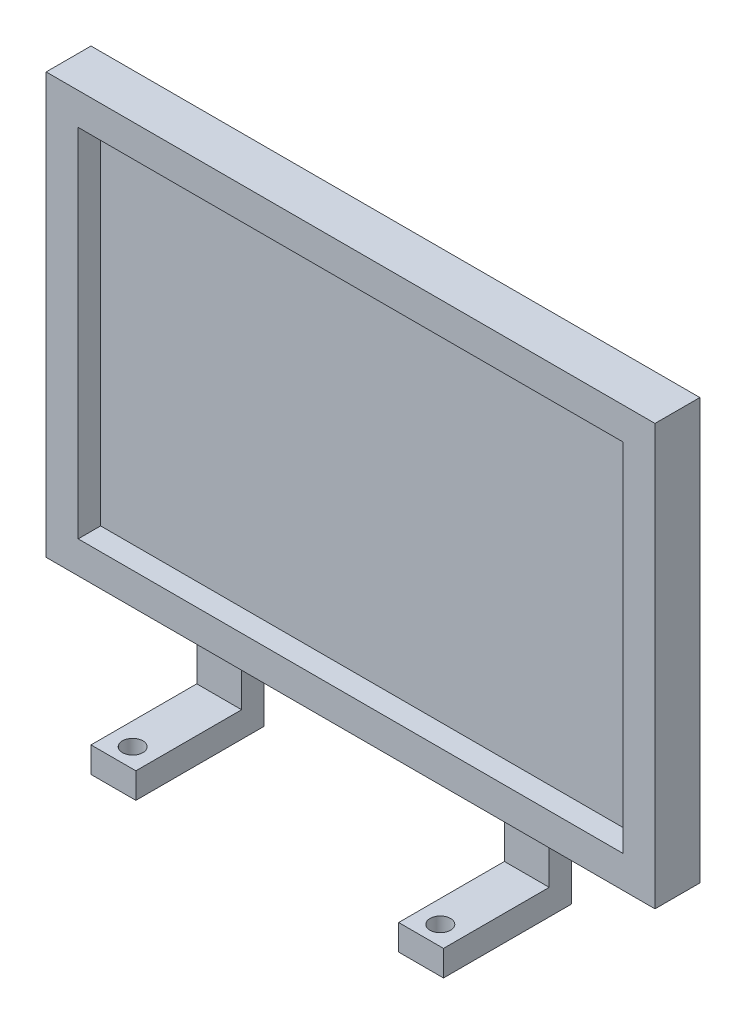
ISO-10303-21;
HEADER;
FILE_DESCRIPTION(('STEP AP214'),'2;1');
FILE_NAME('part.step','',(''),(''),'','','');
FILE_SCHEMA(('AUTOMOTIVE_DESIGN { 1 0 10303 214 1 1 1 1 }'));
ENDSEC;
DATA;
#1=APPLICATION_CONTEXT('core data for automotive mechanical design processes');
#2=APPLICATION_PROTOCOL_DEFINITION('international standard','automotive_design',2000,#1);
#3=PRODUCT_CONTEXT('',#1,'mechanical');
#4=PRODUCT('Part','Part','',(#3));
#5=PRODUCT_RELATED_PRODUCT_CATEGORY('part','',(#4));
#6=PRODUCT_DEFINITION_FORMATION('','',#4);
#7=PRODUCT_DEFINITION_CONTEXT('part definition',#1,'design');
#8=PRODUCT_DEFINITION('design','',#6,#7);
#9=PRODUCT_DEFINITION_SHAPE('','',#8);
#10=(LENGTH_UNIT() NAMED_UNIT(*) SI_UNIT(.MILLI.,.METRE.));
#11=(NAMED_UNIT(*) PLANE_ANGLE_UNIT() SI_UNIT($,.RADIAN.));
#12=(NAMED_UNIT(*) SI_UNIT($,.STERADIAN.) SOLID_ANGLE_UNIT());
#13=UNCERTAINTY_MEASURE_WITH_UNIT(LENGTH_MEASURE(1.E-05),#10,'distance_accuracy_value','');
#14=(GEOMETRIC_REPRESENTATION_CONTEXT(3) GLOBAL_UNCERTAINTY_ASSIGNED_CONTEXT((#13)) GLOBAL_UNIT_ASSIGNED_CONTEXT((#10,
#11,#12)) REPRESENTATION_CONTEXT('',''));
#15=CARTESIAN_POINT('',(0.,0.,0.));
#16=DIRECTION('',(0.,0.,1.));
#17=DIRECTION('',(1.,0.,0.));
#18=AXIS2_PLACEMENT_3D('',#15,#16,#17);
#19=CARTESIAN_POINT('',(0.,-32.8,7.));
#20=DIRECTION('',(0.,1.,0.));
#21=DIRECTION('',(0.,0.,1.));
#22=AXIS2_PLACEMENT_3D('',#19,#20,#21);
#23=PLANE('',#22);
#24=DIRECTION('',(0.,0.,-1.));
#25=VECTOR('',#24,1.);
#26=CARTESIAN_POINT('',(20.5,-32.8,3.5));
#27=LINE('',#26,#25);
#28=CARTESIAN_POINT('',(20.5,-32.8,3.5));
#29=VERTEX_POINT('',#28);
#30=CARTESIAN_POINT('',(20.5,-32.8,0.));
#31=VERTEX_POINT('',#30);
#32=EDGE_CURVE('E64',#29,#31,#27,.T.);
#33=ORIENTED_EDGE('',*,*,#32,.F.);
#34=DIRECTION('',(1.,0.,0.));
#35=VECTOR('',#34,1.);
#36=CARTESIAN_POINT('',(0.,-32.8,3.5));
#37=LINE('',#36,#35);
#38=CARTESIAN_POINT('',(27.5,-32.8,3.5));
#39=VERTEX_POINT('',#38);
#40=EDGE_CURVE('E59',#29,#39,#37,.T.);
#41=ORIENTED_EDGE('',*,*,#40,.T.);
#42=DIRECTION('',(0.,0.,-1.));
#43=VECTOR('',#42,1.);
#44=CARTESIAN_POINT('',(27.5,-32.8,3.5));
#45=LINE('',#44,#43);
#46=CARTESIAN_POINT('',(27.5,-32.8,0.));
#47=VERTEX_POINT('',#46);
#48=EDGE_CURVE('E282',#39,#47,#45,.T.);
#49=ORIENTED_EDGE('',*,*,#48,.T.);
#50=DIRECTION('',(1.,0.,0.));
#51=VECTOR('',#50,1.);
#52=CARTESIAN_POINT('',(0.,-32.8,0.));
#53=LINE('',#52,#51);
#54=CARTESIAN_POINT('',(47.5,-32.8,0.));
#55=VERTEX_POINT('',#54);
#56=EDGE_CURVE('E355',#47,#55,#53,.T.);
#57=ORIENTED_EDGE('',*,*,#56,.T.);
#58=DIRECTION('',(0.,0.,-1.));
#59=VECTOR('',#58,1.);
#60=CARTESIAN_POINT('',(47.5,-32.8,7.));
#61=LINE('',#60,#59);
#62=CARTESIAN_POINT('',(47.5,-32.8,7.));
#63=VERTEX_POINT('',#62);
#64=EDGE_CURVE('E344',#63,#55,#61,.T.);
#65=ORIENTED_EDGE('',*,*,#64,.F.);
#66=DIRECTION('',(1.,0.,0.));
#67=VECTOR('',#66,1.);
#68=CARTESIAN_POINT('',(0.,-32.8,7.));
#69=LINE('',#68,#67);
#70=CARTESIAN_POINT('',(-47.5,-32.8,7.));
#71=VERTEX_POINT('',#70);
#72=EDGE_CURVE('E326',#71,#63,#69,.T.);
#73=ORIENTED_EDGE('',*,*,#72,.F.);
#74=DIRECTION('',(0.,0.,-1.));
#75=VECTOR('',#74,1.);
#76=CARTESIAN_POINT('',(-47.5,-32.8,7.));
#77=LINE('',#76,#75);
#78=CARTESIAN_POINT('',(-47.5,-32.8,0.));
#79=VERTEX_POINT('',#78);
#80=EDGE_CURVE('E380',#71,#79,#77,.T.);
#81=ORIENTED_EDGE('',*,*,#80,.T.);
#82=CARTESIAN_POINT('',(-27.5,-32.8,0.));
#83=VERTEX_POINT('',#82);
#84=EDGE_CURVE('E319',#79,#83,#53,.T.);
#85=ORIENTED_EDGE('',*,*,#84,.T.);
#86=DIRECTION('',(0.,0.,-1.));
#87=VECTOR('',#86,1.);
#88=CARTESIAN_POINT('',(-27.5,-32.8,3.5));
#89=LINE('',#88,#87);
#90=CARTESIAN_POINT('',(-27.5,-32.8,3.5));
#91=VERTEX_POINT('',#90);
#92=EDGE_CURVE('E302',#91,#83,#89,.T.);
#93=ORIENTED_EDGE('',*,*,#92,.F.);
#94=DIRECTION('',(1.,0.,0.));
#95=VECTOR('',#94,1.);
#96=CARTESIAN_POINT('',(0.,-32.8,3.5));
#97=LINE('',#96,#95);
#98=CARTESIAN_POINT('',(-20.5,-32.8,3.5));
#99=VERTEX_POINT('',#98);
#100=EDGE_CURVE('E295',#91,#99,#97,.T.);
#101=ORIENTED_EDGE('',*,*,#100,.T.);
#102=DIRECTION('',(0.,0.,-1.));
#103=VECTOR('',#102,1.);
#104=CARTESIAN_POINT('',(-20.5,-32.8,3.5));
#105=LINE('',#104,#103);
#106=CARTESIAN_POINT('',(-20.5,-32.8,0.));
#107=VERTEX_POINT('',#106);
#108=EDGE_CURVE('E309',#99,#107,#105,.T.);
#109=ORIENTED_EDGE('',*,*,#108,.T.);
#110=EDGE_CURVE('E359',#107,#31,#53,.T.);
#111=ORIENTED_EDGE('',*,*,#110,.T.);
#112=EDGE_LOOP('',(#33,#41,#49,#57,#65,#73,#81,#85,#93,#101,#109,#111));
#113=FACE_BOUND('',#112,.T.);
#114=ADVANCED_FACE('F41',(#113),#23,.F.);
#115=CARTESIAN_POINT('',(0.,0.,3.5));
#116=DIRECTION('',(0.,0.,1.));
#117=DIRECTION('',(1.,0.,0.));
#118=AXIS2_PLACEMENT_3D('',#115,#116,#117);
#119=PLANE('',#118);
#120=DIRECTION('',(0.,-1.,0.));
#121=VECTOR('',#120,1.);
#122=CARTESIAN_POINT('',(42.5,0.,3.5));
#123=LINE('',#122,#121);
#124=CARTESIAN_POINT('',(42.5,27.8,3.5));
#125=VERTEX_POINT('',#124);
#126=CARTESIAN_POINT('',(42.5,-27.8,3.5));
#127=VERTEX_POINT('',#126);
#128=EDGE_CURVE('E376',#125,#127,#123,.T.);
#129=ORIENTED_EDGE('',*,*,#128,.F.);
#130=DIRECTION('',(1.,0.,0.));
#131=VECTOR('',#130,1.);
#132=CARTESIAN_POINT('',(0.,27.8,3.5));
#133=LINE('',#132,#131);
#134=CARTESIAN_POINT('',(-42.5,27.8,3.5));
#135=VERTEX_POINT('',#134);
#136=EDGE_CURVE('E391',#135,#125,#133,.T.);
#137=ORIENTED_EDGE('',*,*,#136,.F.);
#138=DIRECTION('',(0.,-1.,0.));
#139=VECTOR('',#138,1.);
#140=CARTESIAN_POINT('',(-42.5,0.,3.5));
#141=LINE('',#140,#139);
#142=CARTESIAN_POINT('',(-42.5,-27.8,3.5));
#143=VERTEX_POINT('',#142);
#144=EDGE_CURVE('E51',#135,#143,#141,.T.);
#145=ORIENTED_EDGE('',*,*,#144,.T.);
#146=DIRECTION('',(1.,0.,0.));
#147=VECTOR('',#146,1.);
#148=CARTESIAN_POINT('',(0.,-27.8,3.5));
#149=LINE('',#148,#147);
#150=EDGE_CURVE('E11',#143,#127,#149,.T.);
#151=ORIENTED_EDGE('',*,*,#150,.T.);
#152=EDGE_LOOP('',(#129,#137,#145,#151));
#153=FACE_BOUND('',#152,.T.);
#154=ADVANCED_FACE('F441',(#153),#119,.T.);
#155=CARTESIAN_POINT('',(0.,27.8,7.));
#156=DIRECTION('',(0.,1.,0.));
#157=DIRECTION('',(0.,0.,1.));
#158=AXIS2_PLACEMENT_3D('',#155,#156,#157);
#159=PLANE('',#158);
#160=ORIENTED_EDGE('',*,*,#136,.T.);
#161=DIRECTION('',(0.,0.,-1.));
#162=VECTOR('',#161,1.);
#163=CARTESIAN_POINT('',(42.5,27.8,7.));
#164=LINE('',#163,#162);
#165=CARTESIAN_POINT('',(42.5,27.8,7.));
#166=VERTEX_POINT('',#165);
#167=EDGE_CURVE('E372',#166,#125,#164,.T.);
#168=ORIENTED_EDGE('',*,*,#167,.F.);
#169=DIRECTION('',(1.,0.,0.));
#170=VECTOR('',#169,1.);
#171=CARTESIAN_POINT('',(0.,27.8,7.));
#172=LINE('',#171,#170);
#173=CARTESIAN_POINT('',(-42.5,27.8,7.));
#174=VERTEX_POINT('',#173);
#175=EDGE_CURVE('E329',#174,#166,#172,.T.);
#176=ORIENTED_EDGE('',*,*,#175,.F.);
#177=DIRECTION('',(0.,0.,-1.));
#178=VECTOR('',#177,1.);
#179=CARTESIAN_POINT('',(-42.5,27.8,7.));
#180=LINE('',#179,#178);
#181=EDGE_CURVE('E360',#174,#135,#180,.T.);
#182=ORIENTED_EDGE('',*,*,#181,.T.);
#183=EDGE_LOOP('',(#160,#168,#176,#182));
#184=FACE_BOUND('',#183,.T.);
#185=ADVANCED_FACE('F446',(#184),#159,.F.);
#186=CARTESIAN_POINT('',(42.5,0.,7.));
#187=DIRECTION('',(1.,0.,0.));
#188=DIRECTION('',(0.,1.,0.));
#189=AXIS2_PLACEMENT_3D('',#186,#187,#188);
#190=PLANE('',#189);
#191=ORIENTED_EDGE('',*,*,#128,.T.);
#192=DIRECTION('',(0.,0.,-1.));
#193=VECTOR('',#192,1.);
#194=CARTESIAN_POINT('',(42.5,-27.8,7.));
#195=LINE('',#194,#193);
#196=CARTESIAN_POINT('',(42.5,-27.8,7.));
#197=VERTEX_POINT('',#196);
#198=EDGE_CURVE('E368',#197,#127,#195,.T.);
#199=ORIENTED_EDGE('',*,*,#198,.F.);
#200=DIRECTION('',(0.,-1.,0.));
#201=VECTOR('',#200,1.);
#202=CARTESIAN_POINT('',(42.5,0.,7.));
#203=LINE('',#202,#201);
#204=EDGE_CURVE('E333',#166,#197,#203,.T.);
#205=ORIENTED_EDGE('',*,*,#204,.F.);
#206=ORIENTED_EDGE('',*,*,#167,.T.);
#207=EDGE_LOOP('',(#191,#199,#205,#206));
#208=FACE_BOUND('',#207,.T.);
#209=ADVANCED_FACE('F467',(#208),#190,.F.);
#210=CARTESIAN_POINT('',(0.,-27.8,7.));
#211=DIRECTION('',(0.,1.,0.));
#212=DIRECTION('',(0.,0.,1.));
#213=AXIS2_PLACEMENT_3D('',#210,#211,#212);
#214=PLANE('',#213);
#215=ORIENTED_EDGE('',*,*,#198,.T.);
#216=ORIENTED_EDGE('',*,*,#150,.F.);
#217=DIRECTION('',(0.,0.,-1.));
#218=VECTOR('',#217,1.);
#219=CARTESIAN_POINT('',(-42.5,-27.8,7.));
#220=LINE('',#219,#218);
#221=CARTESIAN_POINT('',(-42.5,-27.8,7.));
#222=VERTEX_POINT('',#221);
#223=EDGE_CURVE('E364',#222,#143,#220,.T.);
#224=ORIENTED_EDGE('',*,*,#223,.F.);
#225=DIRECTION('',(1.,0.,0.));
#226=VECTOR('',#225,1.);
#227=CARTESIAN_POINT('',(0.,-27.8,7.));
#228=LINE('',#227,#226);
#229=EDGE_CURVE('E336',#222,#197,#228,.T.);
#230=ORIENTED_EDGE('',*,*,#229,.T.);
#231=EDGE_LOOP('',(#215,#216,#224,#230));
#232=FACE_BOUND('',#231,.T.);
#233=ADVANCED_FACE('F462',(#232),#214,.T.);
#234=CARTESIAN_POINT('',(47.5,0.,7.));
#235=DIRECTION('',(1.,0.,0.));
#236=DIRECTION('',(0.,1.,0.));
#237=AXIS2_PLACEMENT_3D('',#234,#235,#236);
#238=PLANE('',#237);
#239=DIRECTION('',(0.,-1.,0.));
#240=VECTOR('',#239,1.);
#241=CARTESIAN_POINT('',(47.5,0.,0.));
#242=LINE('',#241,#240);
#243=CARTESIAN_POINT('',(47.5,32.8,0.));
#244=VERTEX_POINT('',#243);
#245=EDGE_CURVE('E313',#244,#55,#242,.T.);
#246=ORIENTED_EDGE('',*,*,#245,.F.);
#247=DIRECTION('',(0.,0.,-1.));
#248=VECTOR('',#247,1.);
#249=CARTESIAN_POINT('',(47.5,32.8,7.));
#250=LINE('',#249,#248);
#251=CARTESIAN_POINT('',(47.5,32.8,7.));
#252=VERTEX_POINT('',#251);
#253=EDGE_CURVE('E365',#252,#244,#250,.T.);
#254=ORIENTED_EDGE('',*,*,#253,.F.);
#255=DIRECTION('',(0.,-1.,0.));
#256=VECTOR('',#255,1.);
#257=CARTESIAN_POINT('',(47.5,0.,7.));
#258=LINE('',#257,#256);
#259=EDGE_CURVE('E314',#252,#63,#258,.T.);
#260=ORIENTED_EDGE('',*,*,#259,.T.);
#261=ORIENTED_EDGE('',*,*,#64,.T.);
#262=EDGE_LOOP('',(#246,#254,#260,#261));
#263=FACE_BOUND('',#262,.T.);
#264=ADVANCED_FACE('F459',(#263),#238,.T.);
#265=CARTESIAN_POINT('',(0.,32.8,7.));
#266=DIRECTION('',(0.,1.,0.));
#267=DIRECTION('',(0.,0.,1.));
#268=AXIS2_PLACEMENT_3D('',#265,#266,#267);
#269=PLANE('',#268);
#270=DIRECTION('',(1.,0.,0.));
#271=VECTOR('',#270,1.);
#272=CARTESIAN_POINT('',(0.,32.8,0.));
#273=LINE('',#272,#271);
#274=CARTESIAN_POINT('',(-47.5,32.8,0.));
#275=VERTEX_POINT('',#274);
#276=EDGE_CURVE('E348',#275,#244,#273,.T.);
#277=ORIENTED_EDGE('',*,*,#276,.F.);
#278=DIRECTION('',(0.,0.,-1.));
#279=VECTOR('',#278,1.);
#280=CARTESIAN_POINT('',(-47.5,32.8,7.));
#281=LINE('',#280,#279);
#282=CARTESIAN_POINT('',(-47.5,32.8,7.));
#283=VERTEX_POINT('',#282);
#284=EDGE_CURVE('E384',#283,#275,#281,.T.);
#285=ORIENTED_EDGE('',*,*,#284,.F.);
#286=DIRECTION('',(1.,0.,0.));
#287=VECTOR('',#286,1.);
#288=CARTESIAN_POINT('',(0.,32.8,7.));
#289=LINE('',#288,#287);
#290=EDGE_CURVE('E318',#283,#252,#289,.T.);
#291=ORIENTED_EDGE('',*,*,#290,.T.);
#292=ORIENTED_EDGE('',*,*,#253,.T.);
#293=EDGE_LOOP('',(#277,#285,#291,#292));
#294=FACE_BOUND('',#293,.T.);
#295=ADVANCED_FACE('F455',(#294),#269,.T.);
#296=CARTESIAN_POINT('',(-47.5,0.,7.));
#297=DIRECTION('',(1.,0.,0.));
#298=DIRECTION('',(0.,1.,0.));
#299=AXIS2_PLACEMENT_3D('',#296,#297,#298);
#300=PLANE('',#299);
#301=DIRECTION('',(0.,-1.,0.));
#302=VECTOR('',#301,1.);
#303=CARTESIAN_POINT('',(-47.5,0.,0.));
#304=LINE('',#303,#302);
#305=EDGE_CURVE('E352',#275,#79,#304,.T.);
#306=ORIENTED_EDGE('',*,*,#305,.T.);
#307=ORIENTED_EDGE('',*,*,#80,.F.);
#308=DIRECTION('',(0.,-1.,0.));
#309=VECTOR('',#308,1.);
#310=CARTESIAN_POINT('',(-47.5,0.,7.));
#311=LINE('',#310,#309);
#312=EDGE_CURVE('E323',#283,#71,#311,.T.);
#313=ORIENTED_EDGE('',*,*,#312,.F.);
#314=ORIENTED_EDGE('',*,*,#284,.T.);
#315=EDGE_LOOP('',(#306,#307,#313,#314));
#316=FACE_BOUND('',#315,.T.);
#317=ADVANCED_FACE('F451',(#316),#300,.F.);
#318=CARTESIAN_POINT('',(-42.5,0.,7.));
#319=DIRECTION('',(1.,0.,0.));
#320=DIRECTION('',(0.,1.,0.));
#321=AXIS2_PLACEMENT_3D('',#318,#319,#320);
#322=PLANE('',#321);
#323=ORIENTED_EDGE('',*,*,#223,.T.);
#324=ORIENTED_EDGE('',*,*,#144,.F.);
#325=ORIENTED_EDGE('',*,*,#181,.F.);
#326=DIRECTION('',(0.,-1.,0.));
#327=VECTOR('',#326,1.);
#328=CARTESIAN_POINT('',(-42.5,0.,7.));
#329=LINE('',#328,#327);
#330=EDGE_CURVE('E340',#174,#222,#329,.T.);
#331=ORIENTED_EDGE('',*,*,#330,.T.);
#332=EDGE_LOOP('',(#323,#324,#325,#331));
#333=FACE_BOUND('',#332,.T.);
#334=ADVANCED_FACE('F454',(#333),#322,.T.);
#335=CARTESIAN_POINT('',(0.,0.,7.));
#336=DIRECTION('',(0.,0.,1.));
#337=DIRECTION('',(1.,0.,0.));
#338=AXIS2_PLACEMENT_3D('',#335,#336,#337);
#339=PLANE('',#338);
#340=ORIENTED_EDGE('',*,*,#259,.F.);
#341=ORIENTED_EDGE('',*,*,#290,.F.);
#342=ORIENTED_EDGE('',*,*,#312,.T.);
#343=ORIENTED_EDGE('',*,*,#72,.T.);
#344=EDGE_LOOP('',(#340,#341,#342,#343));
#345=FACE_BOUND('',#344,.T.);
#346=ORIENTED_EDGE('',*,*,#175,.T.);
#347=ORIENTED_EDGE('',*,*,#204,.T.);
#348=ORIENTED_EDGE('',*,*,#229,.F.);
#349=ORIENTED_EDGE('',*,*,#330,.F.);
#350=EDGE_LOOP('',(#346,#347,#348,#349));
#351=FACE_BOUND('',#350,.T.);
#352=ADVANCED_FACE('F479',(#345,#351),#339,.T.);
#353=CARTESIAN_POINT('',(0.,0.,0.));
#354=DIRECTION('',(0.,0.,1.));
#355=DIRECTION('',(1.,0.,0.));
#356=AXIS2_PLACEMENT_3D('',#353,#354,#355);
#357=PLANE('',#356);
#358=ORIENTED_EDGE('',*,*,#245,.T.);
#359=ORIENTED_EDGE('',*,*,#56,.F.);
#360=DIRECTION('',(0.,-1.,0.));
#361=VECTOR('',#360,1.);
#362=CARTESIAN_POINT('',(27.5,0.,0.));
#363=LINE('',#362,#361);
#364=CARTESIAN_POINT('',(27.5,-45.64,0.));
#365=VERTEX_POINT('',#364);
#366=EDGE_CURVE('E267',#47,#365,#363,.T.);
#367=ORIENTED_EDGE('',*,*,#366,.T.);
#368=DIRECTION('',(1.,0.,0.));
#369=VECTOR('',#368,1.);
#370=CARTESIAN_POINT('',(0.,-45.64,0.));
#371=LINE('',#370,#369);
#372=CARTESIAN_POINT('',(20.5,-45.64,0.));
#373=VERTEX_POINT('',#372);
#374=EDGE_CURVE('E208',#373,#365,#371,.T.);
#375=ORIENTED_EDGE('',*,*,#374,.F.);
#376=DIRECTION('',(0.,-1.,0.));
#377=VECTOR('',#376,1.);
#378=CARTESIAN_POINT('',(20.5,0.,0.));
#379=LINE('',#378,#377);
#380=EDGE_CURVE('E263',#31,#373,#379,.T.);
#381=ORIENTED_EDGE('',*,*,#380,.F.);
#382=ORIENTED_EDGE('',*,*,#110,.F.);
#383=DIRECTION('',(0.,-1.,0.));
#384=VECTOR('',#383,1.);
#385=CARTESIAN_POINT('',(-20.5,0.,0.));
#386=LINE('',#385,#384);
#387=CARTESIAN_POINT('',(-20.5,-45.64,0.));
#388=VERTEX_POINT('',#387);
#389=EDGE_CURVE('E285',#107,#388,#386,.T.);
#390=ORIENTED_EDGE('',*,*,#389,.T.);
#391=DIRECTION('',(-1.,0.,0.));
#392=VECTOR('',#391,1.);
#393=CARTESIAN_POINT('',(0.,-45.64,0.));
#394=LINE('',#393,#392);
#395=CARTESIAN_POINT('',(-27.5,-45.64,0.));
#396=VERTEX_POINT('',#395);
#397=EDGE_CURVE('E192',#388,#396,#394,.T.);
#398=ORIENTED_EDGE('',*,*,#397,.T.);
#399=DIRECTION('',(0.,-1.,0.));
#400=VECTOR('',#399,1.);
#401=CARTESIAN_POINT('',(-27.5,0.,0.));
#402=LINE('',#401,#400);
#403=EDGE_CURVE('E291',#83,#396,#402,.T.);
#404=ORIENTED_EDGE('',*,*,#403,.F.);
#405=ORIENTED_EDGE('',*,*,#84,.F.);
#406=ORIENTED_EDGE('',*,*,#305,.F.);
#407=ORIENTED_EDGE('',*,*,#276,.T.);
#408=EDGE_LOOP('',(#358,#359,#367,#375,#381,#382,#390,#398,#404,#405,#406,#407));
#409=FACE_BOUND('',#408,.T.);
#410=ADVANCED_FACE('F43',(#409),#357,.F.);
#411=CARTESIAN_POINT('',(-20.5,0.,3.5));
#412=DIRECTION('',(1.,0.,0.));
#413=DIRECTION('',(0.,0.,-1.));
#414=AXIS2_PLACEMENT_3D('',#411,#412,#413);
#415=PLANE('',#414);
#416=ORIENTED_EDGE('',*,*,#389,.F.);
#417=ORIENTED_EDGE('',*,*,#108,.F.);
#418=DIRECTION('',(0.,-1.,0.));
#419=VECTOR('',#418,1.);
#420=CARTESIAN_POINT('',(-20.5,0.,3.5));
#421=LINE('',#420,#419);
#422=CARTESIAN_POINT('',(-20.5,-41.64,3.5));
#423=VERTEX_POINT('',#422);
#424=EDGE_CURVE('E290',#99,#423,#421,.T.);
#425=ORIENTED_EDGE('',*,*,#424,.T.);
#426=DIRECTION('',(0.,0.,-1.));
#427=VECTOR('',#426,1.);
#428=CARTESIAN_POINT('',(-20.5,-41.64,20.));
#429=LINE('',#428,#427);
#430=CARTESIAN_POINT('',(-20.5,-41.64,20.));
#431=VERTEX_POINT('',#430);
#432=EDGE_CURVE('E259',#431,#423,#429,.T.);
#433=ORIENTED_EDGE('',*,*,#432,.F.);
#434=DIRECTION('',(0.,-1.,0.));
#435=VECTOR('',#434,1.);
#436=CARTESIAN_POINT('',(-20.5,0.,20.));
#437=LINE('',#436,#435);
#438=CARTESIAN_POINT('',(-20.5,-45.64,20.));
#439=VERTEX_POINT('',#438);
#440=EDGE_CURVE('E230',#431,#439,#437,.T.);
#441=ORIENTED_EDGE('',*,*,#440,.T.);
#442=DIRECTION('',(0.,0.,-1.));
#443=VECTOR('',#442,1.);
#444=CARTESIAN_POINT('',(-20.5,-45.64,20.));
#445=LINE('',#444,#443);
#446=EDGE_CURVE('E244',#439,#388,#445,.T.);
#447=ORIENTED_EDGE('',*,*,#446,.T.);
#448=EDGE_LOOP('',(#416,#417,#425,#433,#441,#447));
#449=FACE_BOUND('',#448,.T.);
#450=ADVANCED_FACE('F488',(#449),#415,.T.);
#451=CARTESIAN_POINT('',(-27.5,0.,3.5));
#452=DIRECTION('',(1.,0.,0.));
#453=DIRECTION('',(0.,0.,-1.));
#454=AXIS2_PLACEMENT_3D('',#451,#452,#453);
#455=PLANE('',#454);
#456=ORIENTED_EDGE('',*,*,#403,.T.);
#457=DIRECTION('',(0.,0.,-1.));
#458=VECTOR('',#457,1.);
#459=CARTESIAN_POINT('',(-27.5,-45.64,20.));
#460=LINE('',#459,#458);
#461=CARTESIAN_POINT('',(-27.5,-45.64,20.));
#462=VERTEX_POINT('',#461);
#463=EDGE_CURVE('E251',#462,#396,#460,.T.);
#464=ORIENTED_EDGE('',*,*,#463,.F.);
#465=DIRECTION('',(0.,-1.,0.));
#466=VECTOR('',#465,1.);
#467=CARTESIAN_POINT('',(-27.5,0.,20.));
#468=LINE('',#467,#466);
#469=CARTESIAN_POINT('',(-27.5,-41.64,20.));
#470=VERTEX_POINT('',#469);
#471=EDGE_CURVE('E237',#470,#462,#468,.T.);
#472=ORIENTED_EDGE('',*,*,#471,.F.);
#473=DIRECTION('',(0.,0.,-1.));
#474=VECTOR('',#473,1.);
#475=CARTESIAN_POINT('',(-27.5,-41.64,20.));
#476=LINE('',#475,#474);
#477=CARTESIAN_POINT('',(-27.5,-41.64,3.5));
#478=VERTEX_POINT('',#477);
#479=EDGE_CURVE('E255',#470,#478,#476,.T.);
#480=ORIENTED_EDGE('',*,*,#479,.T.);
#481=DIRECTION('',(0.,-1.,0.));
#482=VECTOR('',#481,1.);
#483=CARTESIAN_POINT('',(-27.5,0.,3.5));
#484=LINE('',#483,#482);
#485=EDGE_CURVE('E299',#91,#478,#484,.T.);
#486=ORIENTED_EDGE('',*,*,#485,.F.);
#487=ORIENTED_EDGE('',*,*,#92,.T.);
#488=EDGE_LOOP('',(#456,#464,#472,#480,#486,#487));
#489=FACE_BOUND('',#488,.T.);
#490=ADVANCED_FACE('F495',(#489),#455,.F.);
#491=CARTESIAN_POINT('',(0.,0.,3.5));
#492=DIRECTION('',(0.,0.,1.));
#493=DIRECTION('',(1.,0.,0.));
#494=AXIS2_PLACEMENT_3D('',#491,#492,#493);
#495=PLANE('',#494);
#496=DIRECTION('',(-1.,0.,0.));
#497=VECTOR('',#496,1.);
#498=CARTESIAN_POINT('',(0.,-41.64,3.5));
#499=LINE('',#498,#497);
#500=EDGE_CURVE('E286',#423,#478,#499,.T.);
#501=ORIENTED_EDGE('',*,*,#500,.F.);
#502=ORIENTED_EDGE('',*,*,#424,.F.);
#503=ORIENTED_EDGE('',*,*,#100,.F.);
#504=ORIENTED_EDGE('',*,*,#485,.T.);
#505=EDGE_LOOP('',(#501,#502,#503,#504));
#506=FACE_BOUND('',#505,.T.);
#507=ADVANCED_FACE('F500',(#506),#495,.T.);
#508=CARTESIAN_POINT('',(20.5,0.,3.5));
#509=DIRECTION('',(1.,0.,0.));
#510=DIRECTION('',(0.,0.,-1.));
#511=AXIS2_PLACEMENT_3D('',#508,#509,#510);
#512=PLANE('',#511);
#513=ORIENTED_EDGE('',*,*,#380,.T.);
#514=DIRECTION('',(0.,0.,-1.));
#515=VECTOR('',#514,1.);
#516=CARTESIAN_POINT('',(20.5,-45.64,20.));
#517=LINE('',#516,#515);
#518=CARTESIAN_POINT('',(20.5,-45.64,20.));
#519=VERTEX_POINT('',#518);
#520=EDGE_CURVE('E193',#519,#373,#517,.T.);
#521=ORIENTED_EDGE('',*,*,#520,.F.);
#522=DIRECTION('',(0.,-1.,0.));
#523=VECTOR('',#522,1.);
#524=CARTESIAN_POINT('',(20.5,0.,20.));
#525=LINE('',#524,#523);
#526=CARTESIAN_POINT('',(20.5,-41.64,20.));
#527=VERTEX_POINT('',#526);
#528=EDGE_CURVE('E196',#527,#519,#525,.T.);
#529=ORIENTED_EDGE('',*,*,#528,.F.);
#530=DIRECTION('',(0.,0.,-1.));
#531=VECTOR('',#530,1.);
#532=CARTESIAN_POINT('',(20.5,-41.64,20.));
#533=LINE('',#532,#531);
#534=CARTESIAN_POINT('',(20.5,-41.64,3.5));
#535=VERTEX_POINT('',#534);
#536=EDGE_CURVE('E181',#527,#535,#533,.T.);
#537=ORIENTED_EDGE('',*,*,#536,.T.);
#538=DIRECTION('',(0.,-1.,0.));
#539=VECTOR('',#538,1.);
#540=CARTESIAN_POINT('',(20.5,0.,3.5));
#541=LINE('',#540,#539);
#542=EDGE_CURVE('E264',#29,#535,#541,.T.);
#543=ORIENTED_EDGE('',*,*,#542,.F.);
#544=ORIENTED_EDGE('',*,*,#32,.T.);
#545=EDGE_LOOP('',(#513,#521,#529,#537,#543,#544));
#546=FACE_BOUND('',#545,.T.);
#547=ADVANCED_FACE('F197',(#546),#512,.F.);
#548=CARTESIAN_POINT('',(27.5,0.,3.5));
#549=DIRECTION('',(1.,0.,0.));
#550=DIRECTION('',(0.,0.,-1.));
#551=AXIS2_PLACEMENT_3D('',#548,#549,#550);
#552=PLANE('',#551);
#553=ORIENTED_EDGE('',*,*,#366,.F.);
#554=ORIENTED_EDGE('',*,*,#48,.F.);
#555=DIRECTION('',(0.,-1.,0.));
#556=VECTOR('',#555,1.);
#557=CARTESIAN_POINT('',(27.5,0.,3.5));
#558=LINE('',#557,#556);
#559=CARTESIAN_POINT('',(27.5,-41.64,3.5));
#560=VERTEX_POINT('',#559);
#561=EDGE_CURVE('E270',#39,#560,#558,.T.);
#562=ORIENTED_EDGE('',*,*,#561,.T.);
#563=DIRECTION('',(0.,0.,-1.));
#564=VECTOR('',#563,1.);
#565=CARTESIAN_POINT('',(27.5,-41.64,20.));
#566=LINE('',#565,#564);
#567=CARTESIAN_POINT('',(27.5,-41.64,20.));
#568=VERTEX_POINT('',#567);
#569=EDGE_CURVE('E220',#568,#560,#566,.T.);
#570=ORIENTED_EDGE('',*,*,#569,.F.);
#571=DIRECTION('',(0.,-1.,0.));
#572=VECTOR('',#571,1.);
#573=CARTESIAN_POINT('',(27.5,0.,20.));
#574=LINE('',#573,#572);
#575=CARTESIAN_POINT('',(27.5,-45.64,20.));
#576=VERTEX_POINT('',#575);
#577=EDGE_CURVE('E206',#568,#576,#574,.T.);
#578=ORIENTED_EDGE('',*,*,#577,.T.);
#579=DIRECTION('',(0.,0.,-1.));
#580=VECTOR('',#579,1.);
#581=CARTESIAN_POINT('',(27.5,-45.64,20.));
#582=LINE('',#581,#580);
#583=EDGE_CURVE('E224',#576,#365,#582,.T.);
#584=ORIENTED_EDGE('',*,*,#583,.T.);
#585=EDGE_LOOP('',(#553,#554,#562,#570,#578,#584));
#586=FACE_BOUND('',#585,.T.);
#587=ADVANCED_FACE('F425',(#586),#552,.T.);
#588=CARTESIAN_POINT('',(0.,0.,3.5));
#589=DIRECTION('',(0.,0.,1.));
#590=DIRECTION('',(1.,0.,0.));
#591=AXIS2_PLACEMENT_3D('',#588,#589,#590);
#592=PLANE('',#591);
#593=ORIENTED_EDGE('',*,*,#542,.T.);
#594=DIRECTION('',(1.,0.,0.));
#595=VECTOR('',#594,1.);
#596=CARTESIAN_POINT('',(0.,-41.64,3.5));
#597=LINE('',#596,#595);
#598=EDGE_CURVE('E188',#535,#560,#597,.T.);
#599=ORIENTED_EDGE('',*,*,#598,.T.);
#600=ORIENTED_EDGE('',*,*,#561,.F.);
#601=ORIENTED_EDGE('',*,*,#40,.F.);
#602=EDGE_LOOP('',(#593,#599,#600,#601));
#603=FACE_BOUND('',#602,.T.);
#604=ADVANCED_FACE('F428',(#603),#592,.T.);
#605=CARTESIAN_POINT('',(0.,-41.64,20.));
#606=DIRECTION('',(0.,-1.,0.));
#607=DIRECTION('',(0.,0.,-1.));
#608=AXIS2_PLACEMENT_3D('',#605,#606,#607);
#609=PLANE('',#608);
#610=CARTESIAN_POINT('',(-24.,-41.64,17.));
#611=DIRECTION('',(0.,-1.,0.));
#612=DIRECTION('',(0.,0.,-1.));
#613=AXIS2_PLACEMENT_3D('',#610,#611,#612);
#614=CIRCLE('',#613,1.6);
#615=CARTESIAN_POINT('',(-24.,-41.64,15.4));
#616=VERTEX_POINT('',#615);
#617=EDGE_CURVE('E212',#616,#616,#614,.T.);
#618=ORIENTED_EDGE('',*,*,#617,.T.);
#619=EDGE_LOOP('',(#618));
#620=FACE_BOUND('',#619,.T.);
#621=ORIENTED_EDGE('',*,*,#500,.T.);
#622=ORIENTED_EDGE('',*,*,#479,.F.);
#623=DIRECTION('',(-1.,0.,0.));
#624=VECTOR('',#623,1.);
#625=CARTESIAN_POINT('',(0.,-41.64,20.));
#626=LINE('',#625,#624);
#627=EDGE_CURVE('E234',#431,#470,#626,.T.);
#628=ORIENTED_EDGE('',*,*,#627,.F.);
#629=ORIENTED_EDGE('',*,*,#432,.T.);
#630=EDGE_LOOP('',(#621,#622,#628,#629));
#631=FACE_BOUND('',#630,.T.);
#632=ADVANCED_FACE('F430',(#620,#631),#609,.F.);
#633=CARTESIAN_POINT('',(0.,-45.64,20.));
#634=DIRECTION('',(0.,-1.,0.));
#635=DIRECTION('',(0.,0.,-1.));
#636=AXIS2_PLACEMENT_3D('',#633,#634,#635);
#637=PLANE('',#636);
#638=CARTESIAN_POINT('',(-24.,-45.64,17.));
#639=DIRECTION('',(0.,-1.,0.));
#640=DIRECTION('',(0.,0.,-1.));
#641=AXIS2_PLACEMENT_3D('',#638,#639,#640);
#642=CIRCLE('',#641,1.6);
#643=CARTESIAN_POINT('',(-24.,-45.64,15.4));
#644=VERTEX_POINT('',#643);
#645=EDGE_CURVE('E396',#644,#644,#642,.T.);
#646=ORIENTED_EDGE('',*,*,#645,.F.);
#647=EDGE_LOOP('',(#646));
#648=FACE_BOUND('',#647,.T.);
#649=ORIENTED_EDGE('',*,*,#397,.F.);
#650=ORIENTED_EDGE('',*,*,#446,.F.);
#651=DIRECTION('',(-1.,0.,0.));
#652=VECTOR('',#651,1.);
#653=CARTESIAN_POINT('',(0.,-45.64,20.));
#654=LINE('',#653,#652);
#655=EDGE_CURVE('E240',#439,#462,#654,.T.);
#656=ORIENTED_EDGE('',*,*,#655,.T.);
#657=ORIENTED_EDGE('',*,*,#463,.T.);
#658=EDGE_LOOP('',(#649,#650,#656,#657));
#659=FACE_BOUND('',#658,.T.);
#660=ADVANCED_FACE('F436',(#648,#659),#637,.T.);
#661=CARTESIAN_POINT('',(0.,0.,20.));
#662=DIRECTION('',(0.,0.,1.));
#663=DIRECTION('',(1.,0.,0.));
#664=AXIS2_PLACEMENT_3D('',#661,#662,#663);
#665=PLANE('',#664);
#666=ORIENTED_EDGE('',*,*,#440,.F.);
#667=ORIENTED_EDGE('',*,*,#627,.T.);
#668=ORIENTED_EDGE('',*,*,#471,.T.);
#669=ORIENTED_EDGE('',*,*,#655,.F.);
#670=EDGE_LOOP('',(#666,#667,#668,#669));
#671=FACE_BOUND('',#670,.T.);
#672=ADVANCED_FACE('F505',(#671),#665,.T.);
#673=CARTESIAN_POINT('',(0.,-41.64,20.));
#674=DIRECTION('',(0.,1.,0.));
#675=DIRECTION('',(0.,0.,1.));
#676=AXIS2_PLACEMENT_3D('',#673,#674,#675);
#677=PLANE('',#676);
#678=CARTESIAN_POINT('',(24.,-41.64,17.));
#679=DIRECTION('',(0.,1.,0.));
#680=DIRECTION('',(0.,0.,1.));
#681=AXIS2_PLACEMENT_3D('',#678,#679,#680);
#682=CIRCLE('',#681,1.6);
#683=CARTESIAN_POINT('',(24.,-41.64,18.6));
#684=VERTEX_POINT('',#683);
#685=EDGE_CURVE('E399',#684,#684,#682,.F.);
#686=ORIENTED_EDGE('',*,*,#685,.T.);
#687=EDGE_LOOP('',(#686));
#688=FACE_BOUND('',#687,.T.);
#689=ORIENTED_EDGE('',*,*,#569,.T.);
#690=ORIENTED_EDGE('',*,*,#598,.F.);
#691=ORIENTED_EDGE('',*,*,#536,.F.);
#692=DIRECTION('',(1.,0.,0.));
#693=VECTOR('',#692,1.);
#694=CARTESIAN_POINT('',(0.,-41.64,20.));
#695=LINE('',#694,#693);
#696=EDGE_CURVE('E185',#527,#568,#695,.T.);
#697=ORIENTED_EDGE('',*,*,#696,.T.);
#698=EDGE_LOOP('',(#689,#690,#691,#697));
#699=FACE_BOUND('',#698,.T.);
#700=ADVANCED_FACE('F183',(#688,#699),#677,.T.);
#701=CARTESIAN_POINT('',(0.,-45.64,20.));
#702=DIRECTION('',(0.,1.,0.));
#703=DIRECTION('',(0.,0.,1.));
#704=AXIS2_PLACEMENT_3D('',#701,#702,#703);
#705=PLANE('',#704);
#706=CARTESIAN_POINT('',(24.,-45.64,17.));
#707=DIRECTION('',(0.,1.,0.));
#708=DIRECTION('',(0.,0.,1.));
#709=AXIS2_PLACEMENT_3D('',#706,#707,#708);
#710=CIRCLE('',#709,1.6);
#711=CARTESIAN_POINT('',(24.,-45.64,18.6));
#712=VERTEX_POINT('',#711);
#713=EDGE_CURVE('E45',#712,#712,#710,.F.);
#714=ORIENTED_EDGE('',*,*,#713,.F.);
#715=EDGE_LOOP('',(#714));
#716=FACE_BOUND('',#715,.T.);
#717=ORIENTED_EDGE('',*,*,#374,.T.);
#718=ORIENTED_EDGE('',*,*,#583,.F.);
#719=DIRECTION('',(1.,0.,0.));
#720=VECTOR('',#719,1.);
#721=CARTESIAN_POINT('',(0.,-45.64,20.));
#722=LINE('',#721,#720);
#723=EDGE_CURVE('E202',#519,#576,#722,.T.);
#724=ORIENTED_EDGE('',*,*,#723,.F.);
#725=ORIENTED_EDGE('',*,*,#520,.T.);
#726=EDGE_LOOP('',(#717,#718,#724,#725));
#727=FACE_BOUND('',#726,.T.);
#728=ADVANCED_FACE('F414',(#716,#727),#705,.F.);
#729=CARTESIAN_POINT('',(0.,0.,20.));
#730=DIRECTION('',(0.,0.,1.));
#731=DIRECTION('',(1.,0.,0.));
#732=AXIS2_PLACEMENT_3D('',#729,#730,#731);
#733=PLANE('',#732);
#734=ORIENTED_EDGE('',*,*,#696,.F.);
#735=ORIENTED_EDGE('',*,*,#528,.T.);
#736=ORIENTED_EDGE('',*,*,#723,.T.);
#737=ORIENTED_EDGE('',*,*,#577,.F.);
#738=EDGE_LOOP('',(#734,#735,#736,#737));
#739=FACE_BOUND('',#738,.T.);
#740=ADVANCED_FACE('F204',(#739),#733,.T.);
#741=CARTESIAN_POINT('',(-24.,32.8,17.));
#742=DIRECTION('',(0.,-1.,0.));
#743=DIRECTION('',(0.,0.,-1.));
#744=AXIS2_PLACEMENT_3D('',#741,#742,#743);
#745=CYLINDRICAL_SURFACE('',#744,1.6);
#746=ORIENTED_EDGE('',*,*,#645,.T.);
#747=EDGE_LOOP('',(#746));
#748=FACE_BOUND('',#747,.T.);
#749=ORIENTED_EDGE('',*,*,#617,.F.);
#750=EDGE_LOOP('',(#749));
#751=FACE_BOUND('',#750,.T.);
#752=ADVANCED_FACE('F518',(#748,#751),#745,.F.);
#753=CARTESIAN_POINT('',(24.,32.8,17.));
#754=DIRECTION('',(0.,-1.,0.));
#755=DIRECTION('',(0.,0.,-1.));
#756=AXIS2_PLACEMENT_3D('',#753,#754,#755);
#757=CYLINDRICAL_SURFACE('',#756,1.6);
#758=ORIENTED_EDGE('',*,*,#685,.F.);
#759=EDGE_LOOP('',(#758));
#760=FACE_BOUND('',#759,.T.);
#761=ORIENTED_EDGE('',*,*,#713,.T.);
#762=EDGE_LOOP('',(#761));
#763=FACE_BOUND('',#762,.T.);
#764=ADVANCED_FACE('F412',(#760,#763),#757,.F.);
#765=CLOSED_SHELL('',(#114,#154,#185,#209,#233,#264,#295,#317,#334,#352,#410,#450,#490,#507,
#547,#587,#604,#632,#660,#672,#700,#728,#740,#752,#764));
#766=MANIFOLD_SOLID_BREP('B2',#765);
#767=ADVANCED_BREP_SHAPE_REPRESENTATION('',(#18,#766),#14);
#768=SHAPE_DEFINITION_REPRESENTATION(#9,#767);
ENDSEC;
END-ISO-10303-21;
